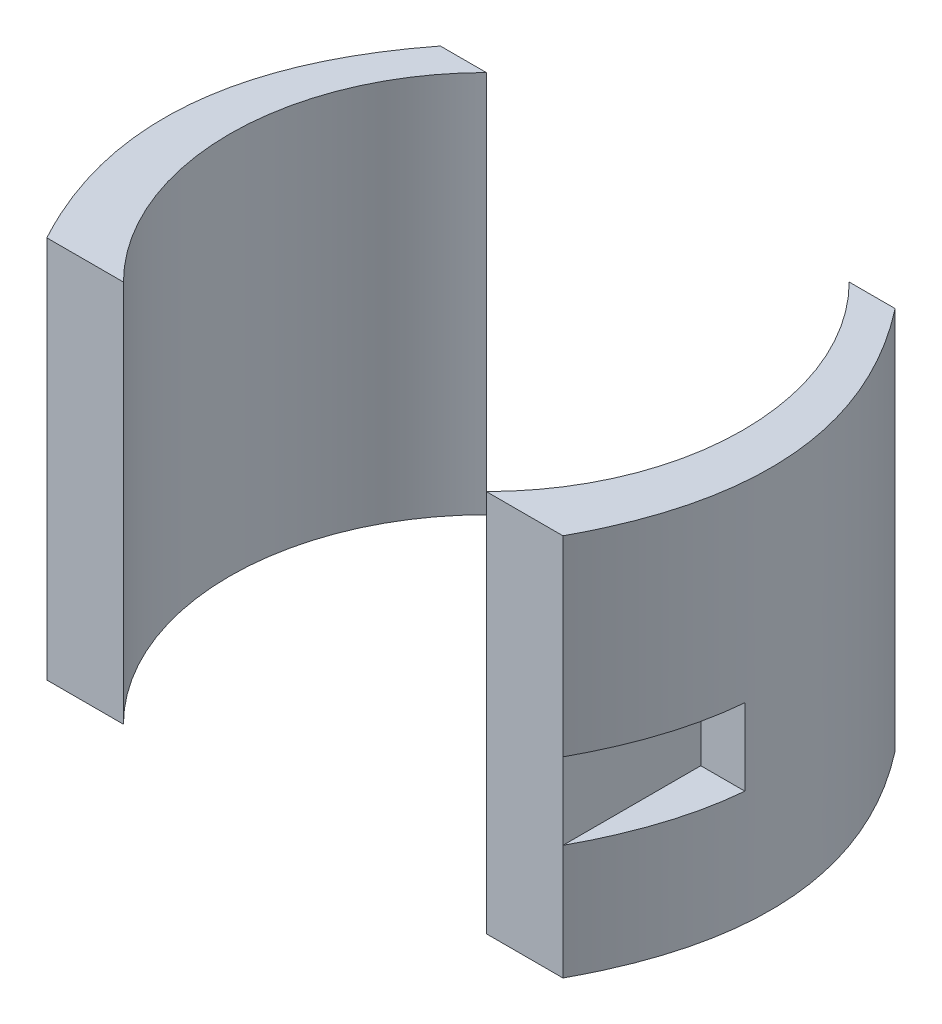
ISO-10303-21;
HEADER;
FILE_DESCRIPTION(('STEP AP214'),'2;1');
FILE_NAME('part.step','',(''),(''),'','','');
FILE_SCHEMA(('AUTOMOTIVE_DESIGN { 1 0 10303 214 1 1 1 1 }'));
ENDSEC;
DATA;
#1=APPLICATION_CONTEXT('core data for automotive mechanical design processes');
#2=APPLICATION_PROTOCOL_DEFINITION('international standard','automotive_design',2000,#1);
#3=PRODUCT_CONTEXT('',#1,'mechanical');
#4=PRODUCT('Part','Part','',(#3));
#5=PRODUCT_RELATED_PRODUCT_CATEGORY('part','',(#4));
#6=PRODUCT_DEFINITION_FORMATION('','',#4);
#7=PRODUCT_DEFINITION_CONTEXT('part definition',#1,'design');
#8=PRODUCT_DEFINITION('design','',#6,#7);
#9=PRODUCT_DEFINITION_SHAPE('','',#8);
#10=(LENGTH_UNIT() NAMED_UNIT(*) SI_UNIT(.MILLI.,.METRE.));
#11=(NAMED_UNIT(*) PLANE_ANGLE_UNIT() SI_UNIT($,.RADIAN.));
#12=(NAMED_UNIT(*) SI_UNIT($,.STERADIAN.) SOLID_ANGLE_UNIT());
#13=UNCERTAINTY_MEASURE_WITH_UNIT(LENGTH_MEASURE(1.E-05),#10,'distance_accuracy_value','');
#14=(GEOMETRIC_REPRESENTATION_CONTEXT(3) GLOBAL_UNCERTAINTY_ASSIGNED_CONTEXT((#13)) GLOBAL_UNIT_ASSIGNED_CONTEXT((#10,
#11,#12)) REPRESENTATION_CONTEXT('',''));
#15=CARTESIAN_POINT('',(0.,0.,0.));
#16=DIRECTION('',(0.,0.,1.));
#17=DIRECTION('',(1.,0.,0.));
#18=AXIS2_PLACEMENT_3D('',#15,#16,#17);
#19=CARTESIAN_POINT('',(29.6880771697493,50.,-23.6880771697493));
#20=CARTESIAN_POINT('',(47.2217353331707,50.,-1.18361385183468));
#21=CARTESIAN_POINT('',(33.6880771697494,50.,23.6880771697493));
#22=B_SPLINE_CURVE_WITH_KNOTS('',2,(#19,#20,#21),.UNSPECIFIED.,.F.,.F.,(3,3),(0.,1.),.UNSPECIFIED.);
#23=DIRECTION('',(0.,-1.,0.));
#24=VECTOR('',#23,1.);
#25=SURFACE_OF_LINEAR_EXTRUSION('',#22,#24);
#26=CARTESIAN_POINT('',(29.6880771697493,25.,-23.6880771697493));
#27=CARTESIAN_POINT('',(47.2217353331707,25.,-1.18361385183468));
#28=CARTESIAN_POINT('',(33.6880771697494,25.,23.6880771697493));
#29=B_SPLINE_CURVE_WITH_KNOTS('',2,(#26,#27,#28),.UNSPECIFIED.,.F.,.F.,(3,3),(0.,1.),.UNSPECIFIED.);
#30=CARTESIAN_POINT('',(39.4429006357392,25.,5.68807716974934));
#31=VERTEX_POINT('',#30);
#32=CARTESIAN_POINT('',(33.6880771697493,25.,23.6880771697493));
#33=VERTEX_POINT('',#32);
#34=EDGE_CURVE('E12',#31,#33,#29,.T.);
#35=ORIENTED_EDGE('',*,*,#34,.F.);
#36=DIRECTION('',(0.,-1.,0.));
#37=VECTOR('',#36,1.);
#38=CARTESIAN_POINT('',(39.4429006357392,50.,5.68807716974934));
#39=LINE('',#38,#37);
#40=CARTESIAN_POINT('',(39.4429006357392,15.,5.68807716974934));
#41=VERTEX_POINT('',#40);
#42=EDGE_CURVE('E130',#41,#31,#39,.F.);
#43=ORIENTED_EDGE('',*,*,#42,.F.);
#44=CARTESIAN_POINT('',(29.6880771697493,15.,-23.6880771697493));
#45=CARTESIAN_POINT('',(47.2217353331707,15.,-1.18361385183468));
#46=CARTESIAN_POINT('',(33.6880771697494,15.,23.6880771697493));
#47=B_SPLINE_CURVE_WITH_KNOTS('',2,(#44,#45,#46),.UNSPECIFIED.,.F.,.F.,(3,3),(0.,1.),.UNSPECIFIED.);
#48=CARTESIAN_POINT('',(33.6880771697494,15.,23.6880771697493));
#49=VERTEX_POINT('',#48);
#50=EDGE_CURVE('E63',#49,#41,#47,.F.);
#51=ORIENTED_EDGE('',*,*,#50,.F.);
#52=DIRECTION('',(0.,-1.,0.));
#53=VECTOR('',#52,1.);
#54=CARTESIAN_POINT('',(33.6880771697493,50.,23.6880771697493));
#55=LINE('',#54,#53);
#56=CARTESIAN_POINT('',(33.6880771697493,0.,23.6880771697493));
#57=VERTEX_POINT('',#56);
#58=EDGE_CURVE('E101',#49,#57,#55,.T.);
#59=ORIENTED_EDGE('',*,*,#58,.T.);
#60=CARTESIAN_POINT('',(29.6880771697493,0.,-23.6880771697493));
#61=CARTESIAN_POINT('',(47.2217353331707,0.,-1.18361385183468));
#62=CARTESIAN_POINT('',(33.6880771697494,0.,23.6880771697493));
#63=B_SPLINE_CURVE_WITH_KNOTS('',2,(#60,#61,#62),.UNSPECIFIED.,.F.,.F.,(3,3),(0.,1.),.UNSPECIFIED.);
#64=CARTESIAN_POINT('',(29.6880771697493,0.,-23.6880771697493));
#65=VERTEX_POINT('',#64);
#66=EDGE_CURVE('E146',#65,#57,#63,.T.);
#67=ORIENTED_EDGE('',*,*,#66,.F.);
#68=DIRECTION('',(0.,-1.,0.));
#69=VECTOR('',#68,1.);
#70=CARTESIAN_POINT('',(29.6880771697493,50.,-23.6880771697493));
#71=LINE('',#70,#69);
#72=CARTESIAN_POINT('',(29.6880771697493,50.,-23.6880771697493));
#73=VERTEX_POINT('',#72);
#74=EDGE_CURVE('E106',#73,#65,#71,.T.);
#75=ORIENTED_EDGE('',*,*,#74,.F.);
#76=CARTESIAN_POINT('',(33.6880771697493,50.,23.6880771697493));
#77=VERTEX_POINT('',#76);
#78=EDGE_CURVE('E147',#73,#77,#22,.T.);
#79=ORIENTED_EDGE('',*,*,#78,.T.);
#80=EDGE_CURVE('E177',#77,#33,#55,.T.);
#81=ORIENTED_EDGE('',*,*,#80,.T.);
#82=EDGE_LOOP('',(#35,#43,#51,#59,#67,#75,#79,#81));
#83=FACE_BOUND('',#82,.T.);
#84=ADVANCED_FACE('F53',(#83),#25,.T.);
#85=CARTESIAN_POINT('',(0.,50.,-23.6880771697493));
#86=DIRECTION('',(0.,0.,-1.));
#87=DIRECTION('',(-1.,0.,0.));
#88=AXIS2_PLACEMENT_3D('',#85,#86,#87);
#89=PLANE('',#88);
#90=DIRECTION('',(1.,0.,0.));
#91=VECTOR('',#90,1.);
#92=CARTESIAN_POINT('',(0.,0.,-23.6880771697493));
#93=LINE('',#92,#91);
#94=CARTESIAN_POINT('',(23.6880771697493,0.,-23.6880771697493));
#95=VERTEX_POINT('',#94);
#96=EDGE_CURVE('E167',#95,#65,#93,.T.);
#97=ORIENTED_EDGE('',*,*,#96,.F.);
#98=DIRECTION('',(0.,-1.,0.));
#99=VECTOR('',#98,1.);
#100=CARTESIAN_POINT('',(23.6880771697493,50.,-23.6880771697493));
#101=LINE('',#100,#99);
#102=CARTESIAN_POINT('',(23.6880771697493,50.,-23.6880771697493));
#103=VERTEX_POINT('',#102);
#104=EDGE_CURVE('E182',#103,#95,#101,.T.);
#105=ORIENTED_EDGE('',*,*,#104,.F.);
#106=DIRECTION('',(1.,0.,0.));
#107=VECTOR('',#106,1.);
#108=CARTESIAN_POINT('',(0.,50.,-23.6880771697493));
#109=LINE('',#108,#107);
#110=EDGE_CURVE('E152',#103,#73,#109,.T.);
#111=ORIENTED_EDGE('',*,*,#110,.T.);
#112=ORIENTED_EDGE('',*,*,#74,.T.);
#113=EDGE_LOOP('',(#97,#105,#111,#112));
#114=FACE_BOUND('',#113,.T.);
#115=ADVANCED_FACE('F200',(#114),#89,.T.);
#116=CARTESIAN_POINT('',(0.,50.,0.));
#117=DIRECTION('',(0.,-1.,0.));
#118=DIRECTION('',(0.,0.,-1.));
#119=AXIS2_PLACEMENT_3D('',#116,#117,#118);
#120=CYLINDRICAL_SURFACE('',#119,33.5);
#121=CARTESIAN_POINT('',(0.,0.,0.));
#122=DIRECTION('',(0.,1.,0.));
#123=DIRECTION('',(0.,0.,1.));
#124=AXIS2_PLACEMENT_3D('',#121,#122,#123);
#125=CIRCLE('',#124,33.5);
#126=CARTESIAN_POINT('',(23.6880771697494,0.,23.6880771697493));
#127=VERTEX_POINT('',#126);
#128=EDGE_CURVE('E173',#127,#95,#125,.T.);
#129=ORIENTED_EDGE('',*,*,#128,.F.);
#130=DIRECTION('',(0.,-1.,0.));
#131=VECTOR('',#130,1.);
#132=CARTESIAN_POINT('',(23.6880771697494,50.,23.6880771697493));
#133=LINE('',#132,#131);
#134=CARTESIAN_POINT('',(23.6880771697494,50.,23.6880771697493));
#135=VERTEX_POINT('',#134);
#136=EDGE_CURVE('E180',#135,#127,#133,.T.);
#137=ORIENTED_EDGE('',*,*,#136,.F.);
#138=CARTESIAN_POINT('',(0.,50.,0.));
#139=DIRECTION('',(0.,1.,0.));
#140=DIRECTION('',(0.,0.,1.));
#141=AXIS2_PLACEMENT_3D('',#138,#139,#140);
#142=CIRCLE('',#141,33.5);
#143=EDGE_CURVE('E159',#135,#103,#142,.T.);
#144=ORIENTED_EDGE('',*,*,#143,.T.);
#145=ORIENTED_EDGE('',*,*,#104,.T.);
#146=EDGE_LOOP('',(#129,#137,#144,#145));
#147=FACE_BOUND('',#146,.T.);
#148=ADVANCED_FACE('F204',(#147),#120,.F.);
#149=CARTESIAN_POINT('',(0.,50.,23.6880771697493));
#150=DIRECTION('',(0.,0.,-1.));
#151=DIRECTION('',(-1.,0.,0.));
#152=AXIS2_PLACEMENT_3D('',#149,#150,#151);
#153=PLANE('',#152);
#154=DIRECTION('',(1.,0.,0.));
#155=VECTOR('',#154,1.);
#156=CARTESIAN_POINT('',(0.,0.,23.6880771697493));
#157=LINE('',#156,#155);
#158=EDGE_CURVE('E153',#127,#57,#157,.T.);
#159=ORIENTED_EDGE('',*,*,#158,.T.);
#160=ORIENTED_EDGE('',*,*,#58,.F.);
#161=DIRECTION('',(0.,-1.,0.));
#162=VECTOR('',#161,1.);
#163=CARTESIAN_POINT('',(33.6880771697494,25.,23.6880771697493));
#164=LINE('',#163,#162);
#165=EDGE_CURVE('E133',#33,#49,#164,.T.);
#166=ORIENTED_EDGE('',*,*,#165,.F.);
#167=ORIENTED_EDGE('',*,*,#80,.F.);
#168=DIRECTION('',(1.,0.,0.));
#169=VECTOR('',#168,1.);
#170=CARTESIAN_POINT('',(0.,50.,23.6880771697493));
#171=LINE('',#170,#169);
#172=EDGE_CURVE('E78',#135,#77,#171,.T.);
#173=ORIENTED_EDGE('',*,*,#172,.F.);
#174=ORIENTED_EDGE('',*,*,#136,.T.);
#175=EDGE_LOOP('',(#159,#160,#166,#167,#173,#174));
#176=FACE_BOUND('',#175,.T.);
#177=ADVANCED_FACE('F193',(#176),#153,.F.);
#178=CARTESIAN_POINT('',(0.,50.,0.));
#179=DIRECTION('',(0.,1.,0.));
#180=DIRECTION('',(0.,0.,1.));
#181=AXIS2_PLACEMENT_3D('',#178,#179,#180);
#182=PLANE('',#181);
#183=ORIENTED_EDGE('',*,*,#78,.F.);
#184=ORIENTED_EDGE('',*,*,#110,.F.);
#185=ORIENTED_EDGE('',*,*,#143,.F.);
#186=ORIENTED_EDGE('',*,*,#172,.T.);
#187=EDGE_LOOP('',(#183,#184,#185,#186));
#188=FACE_BOUND('',#187,.T.);
#189=ADVANCED_FACE('F202',(#188),#182,.T.);
#190=CARTESIAN_POINT('',(0.,0.,0.));
#191=DIRECTION('',(0.,1.,0.));
#192=DIRECTION('',(0.,0.,1.));
#193=AXIS2_PLACEMENT_3D('',#190,#191,#192);
#194=PLANE('',#193);
#195=ORIENTED_EDGE('',*,*,#66,.T.);
#196=ORIENTED_EDGE('',*,*,#158,.F.);
#197=ORIENTED_EDGE('',*,*,#128,.T.);
#198=ORIENTED_EDGE('',*,*,#96,.T.);
#199=EDGE_LOOP('',(#195,#196,#197,#198));
#200=FACE_BOUND('',#199,.T.);
#201=ADVANCED_FACE('F197',(#200),#194,.F.);
#202=CARTESIAN_POINT('',(33.6880771697494,25.,5.68807716974934));
#203=DIRECTION('',(0.,1.,0.));
#204=DIRECTION('',(0.,0.,1.));
#205=AXIS2_PLACEMENT_3D('',#202,#203,#204);
#206=PLANE('',#205);
#207=ORIENTED_EDGE('',*,*,#34,.T.);
#208=DIRECTION('',(0.,0.,1.));
#209=VECTOR('',#208,1.);
#210=CARTESIAN_POINT('',(33.6880771697494,25.,5.68807716974934));
#211=LINE('',#210,#209);
#212=CARTESIAN_POINT('',(33.6880771697494,25.,5.68807716974934));
#213=VERTEX_POINT('',#212);
#214=EDGE_CURVE('E70',#213,#33,#211,.T.);
#215=ORIENTED_EDGE('',*,*,#214,.F.);
#216=DIRECTION('',(-1.,0.,0.));
#217=VECTOR('',#216,1.);
#218=CARTESIAN_POINT('',(33.6880771697494,25.,5.68807716974934));
#219=LINE('',#218,#217);
#220=EDGE_CURVE('E125',#31,#213,#219,.T.);
#221=ORIENTED_EDGE('',*,*,#220,.F.);
#222=EDGE_LOOP('',(#207,#215,#221));
#223=FACE_BOUND('',#222,.T.);
#224=ADVANCED_FACE('F135',(#223),#206,.F.);
#225=CARTESIAN_POINT('',(33.6880771697494,15.,5.68807716974934));
#226=DIRECTION('',(0.,-1.,0.));
#227=DIRECTION('',(1.,0.,0.));
#228=AXIS2_PLACEMENT_3D('',#225,#226,#227);
#229=PLANE('',#228);
#230=ORIENTED_EDGE('',*,*,#50,.T.);
#231=DIRECTION('',(1.,0.,0.));
#232=VECTOR('',#231,1.);
#233=CARTESIAN_POINT('',(33.6880771697494,15.,5.68807716974934));
#234=LINE('',#233,#232);
#235=CARTESIAN_POINT('',(33.6880771697494,15.,5.68807716974934));
#236=VERTEX_POINT('',#235);
#237=EDGE_CURVE('E138',#236,#41,#234,.T.);
#238=ORIENTED_EDGE('',*,*,#237,.F.);
#239=DIRECTION('',(0.,0.,1.));
#240=VECTOR('',#239,1.);
#241=CARTESIAN_POINT('',(33.6880771697494,15.,5.68807716974934));
#242=LINE('',#241,#240);
#243=EDGE_CURVE('E137',#236,#49,#242,.T.);
#244=ORIENTED_EDGE('',*,*,#243,.T.);
#245=EDGE_LOOP('',(#230,#238,#244));
#246=FACE_BOUND('',#245,.T.);
#247=ADVANCED_FACE('F191',(#246),#229,.F.);
#248=CARTESIAN_POINT('',(33.6880771697494,25.,5.68807716974934));
#249=DIRECTION('',(-1.,0.,0.));
#250=DIRECTION('',(0.,-1.,0.));
#251=AXIS2_PLACEMENT_3D('',#248,#249,#250);
#252=PLANE('',#251);
#253=ORIENTED_EDGE('',*,*,#165,.T.);
#254=ORIENTED_EDGE('',*,*,#243,.F.);
#255=DIRECTION('',(0.,-1.,0.));
#256=VECTOR('',#255,1.);
#257=CARTESIAN_POINT('',(33.6880771697494,25.,5.68807716974934));
#258=LINE('',#257,#256);
#259=EDGE_CURVE('E128',#213,#236,#258,.T.);
#260=ORIENTED_EDGE('',*,*,#259,.F.);
#261=ORIENTED_EDGE('',*,*,#214,.T.);
#262=EDGE_LOOP('',(#253,#254,#260,#261));
#263=FACE_BOUND('',#262,.T.);
#264=ADVANCED_FACE('F140',(#263),#252,.F.);
#265=CARTESIAN_POINT('',(0.,0.,5.68807716974934));
#266=DIRECTION('',(0.,0.,-1.));
#267=DIRECTION('',(-1.,0.,0.));
#268=AXIS2_PLACEMENT_3D('',#265,#266,#267);
#269=PLANE('',#268);
#270=ORIENTED_EDGE('',*,*,#42,.T.);
#271=ORIENTED_EDGE('',*,*,#220,.T.);
#272=ORIENTED_EDGE('',*,*,#259,.T.);
#273=ORIENTED_EDGE('',*,*,#237,.T.);
#274=EDGE_LOOP('',(#270,#271,#272,#273));
#275=FACE_BOUND('',#274,.T.);
#276=ADVANCED_FACE('F126',(#275),#269,.F.);
#277=CLOSED_SHELL('',(#84,#115,#148,#177,#189,#201,#224,#247,#264,#276));
#278=MANIFOLD_SOLID_BREP('B2',#277);
#279=CARTESIAN_POINT('',(0.,50.,-23.6880771697493));
#280=DIRECTION('',(0.,0.,1.));
#281=DIRECTION('',(1.,0.,0.));
#282=AXIS2_PLACEMENT_3D('',#279,#280,#281);
#283=PLANE('',#282);
#284=DIRECTION('',(-1.,0.,0.));
#285=VECTOR('',#284,1.);
#286=CARTESIAN_POINT('',(0.,0.,-23.6880771697493));
#287=LINE('',#286,#285);
#288=CARTESIAN_POINT('',(-23.6880771697493,0.,-23.6880771697493));
#289=VERTEX_POINT('',#288);
#290=CARTESIAN_POINT('',(-29.6880771697493,0.,-23.6880771697493));
#291=VERTEX_POINT('',#290);
#292=EDGE_CURVE('E387',#289,#291,#287,.T.);
#293=ORIENTED_EDGE('',*,*,#292,.T.);
#294=DIRECTION('',(0.,-1.,0.));
#295=VECTOR('',#294,1.);
#296=CARTESIAN_POINT('',(-29.6880771697493,50.,-23.6880771697493));
#297=LINE('',#296,#295);
#298=CARTESIAN_POINT('',(-29.6880771697493,50.,-23.6880771697493));
#299=VERTEX_POINT('',#298);
#300=EDGE_CURVE('E436',#299,#291,#297,.T.);
#301=ORIENTED_EDGE('',*,*,#300,.F.);
#302=DIRECTION('',(-1.,0.,0.));
#303=VECTOR('',#302,1.);
#304=CARTESIAN_POINT('',(0.,50.,-23.6880771697493));
#305=LINE('',#304,#303);
#306=CARTESIAN_POINT('',(-23.6880771697493,50.,-23.6880771697493));
#307=VERTEX_POINT('',#306);
#308=EDGE_CURVE('E389',#307,#299,#305,.T.);
#309=ORIENTED_EDGE('',*,*,#308,.F.);
#310=DIRECTION('',(0.,-1.,0.));
#311=VECTOR('',#310,1.);
#312=CARTESIAN_POINT('',(-23.6880771697493,50.,-23.6880771697493));
#313=LINE('',#312,#311);
#314=EDGE_CURVE('E315',#307,#289,#313,.T.);
#315=ORIENTED_EDGE('',*,*,#314,.T.);
#316=EDGE_LOOP('',(#293,#301,#309,#315));
#317=FACE_BOUND('',#316,.T.);
#318=ADVANCED_FACE('F289',(#317),#283,.F.);
#319=CARTESIAN_POINT('',(-29.6880771697493,50.,-23.6880771697493));
#320=CARTESIAN_POINT('',(-47.2217353331707,50.,-1.18361385183467));
#321=CARTESIAN_POINT('',(-33.6880771697493,50.,23.6880771697493));
#322=B_SPLINE_CURVE_WITH_KNOTS('',2,(#319,#320,#321),.UNSPECIFIED.,.F.,.F.,(3,3),(0.,1.),.UNSPECIFIED.);
#323=DIRECTION('',(0.,-1.,0.));
#324=VECTOR('',#323,1.);
#325=SURFACE_OF_LINEAR_EXTRUSION('',#322,#324);
#326=DIRECTION('',(0.,-1.,0.));
#327=VECTOR('',#326,1.);
#328=CARTESIAN_POINT('',(-33.6880771697493,50.,23.6880771697493));
#329=LINE('',#328,#327);
#330=CARTESIAN_POINT('',(-33.6880771697493,15.,23.6880771697493));
#331=VERTEX_POINT('',#330);
#332=CARTESIAN_POINT('',(-33.6880771697493,0.,23.6880771697493));
#333=VERTEX_POINT('',#332);
#334=EDGE_CURVE('E462',#331,#333,#329,.T.);
#335=ORIENTED_EDGE('',*,*,#334,.F.);
#336=CARTESIAN_POINT('',(-29.6880771697493,15.,-23.6880771697493));
#337=CARTESIAN_POINT('',(-47.2217353331707,15.,-1.18361385183467));
#338=CARTESIAN_POINT('',(-33.6880771697493,15.,23.6880771697493));
#339=B_SPLINE_CURVE_WITH_KNOTS('',2,(#336,#337,#338),.UNSPECIFIED.,.F.,.F.,(3,3),(0.,1.),.UNSPECIFIED.);
#340=CARTESIAN_POINT('',(-39.4429006357392,15.,5.68807716974934));
#341=VERTEX_POINT('',#340);
#342=EDGE_CURVE('E51',#331,#341,#339,.F.);
#343=ORIENTED_EDGE('',*,*,#342,.T.);
#344=DIRECTION('',(0.,-1.,0.));
#345=VECTOR('',#344,1.);
#346=CARTESIAN_POINT('',(-39.4429006357392,50.,5.68807716974934));
#347=LINE('',#346,#345);
#348=CARTESIAN_POINT('',(-39.4429006357392,25.,5.68807716974934));
#349=VERTEX_POINT('',#348);
#350=EDGE_CURVE('E469',#341,#349,#347,.F.);
#351=ORIENTED_EDGE('',*,*,#350,.T.);
#352=CARTESIAN_POINT('',(-29.6880771697493,25.,-23.6880771697493));
#353=CARTESIAN_POINT('',(-47.2217353331707,25.,-1.18361385183467));
#354=CARTESIAN_POINT('',(-33.6880771697493,25.,23.6880771697493));
#355=B_SPLINE_CURVE_WITH_KNOTS('',2,(#352,#353,#354),.UNSPECIFIED.,.F.,.F.,(3,3),(0.,1.),.UNSPECIFIED.);
#356=CARTESIAN_POINT('',(-33.6880771697493,25.,23.6880771697493));
#357=VERTEX_POINT('',#356);
#358=EDGE_CURVE('E299',#349,#357,#355,.T.);
#359=ORIENTED_EDGE('',*,*,#358,.T.);
#360=CARTESIAN_POINT('',(-33.6880771697493,50.,23.6880771697493));
#361=VERTEX_POINT('',#360);
#362=EDGE_CURVE('E463',#361,#357,#329,.T.);
#363=ORIENTED_EDGE('',*,*,#362,.F.);
#364=EDGE_CURVE('E342',#299,#361,#322,.T.);
#365=ORIENTED_EDGE('',*,*,#364,.F.);
#366=ORIENTED_EDGE('',*,*,#300,.T.);
#367=CARTESIAN_POINT('',(-29.6880771697493,0.,-23.6880771697493));
#368=CARTESIAN_POINT('',(-47.2217353331707,0.,-1.18361385183467));
#369=CARTESIAN_POINT('',(-33.6880771697493,0.,23.6880771697493));
#370=B_SPLINE_CURVE_WITH_KNOTS('',2,(#367,#368,#369),.UNSPECIFIED.,.F.,.F.,(3,3),(0.,1.),.UNSPECIFIED.);
#371=EDGE_CURVE('E439',#291,#333,#370,.T.);
#372=ORIENTED_EDGE('',*,*,#371,.T.);
#373=EDGE_LOOP('',(#335,#343,#351,#359,#363,#365,#366,#372));
#374=FACE_BOUND('',#373,.T.);
#375=ADVANCED_FACE('F403',(#374),#325,.F.);
#376=CARTESIAN_POINT('',(0.,50.,23.6880771697493));
#377=DIRECTION('',(0.,0.,1.));
#378=DIRECTION('',(1.,0.,0.));
#379=AXIS2_PLACEMENT_3D('',#376,#377,#378);
#380=PLANE('',#379);
#381=DIRECTION('',(-1.,0.,0.));
#382=VECTOR('',#381,1.);
#383=CARTESIAN_POINT('',(0.,0.,23.6880771697493));
#384=LINE('',#383,#382);
#385=CARTESIAN_POINT('',(-23.6880771697493,0.,23.6880771697493));
#386=VERTEX_POINT('',#385);
#387=EDGE_CURVE('E443',#386,#333,#384,.T.);
#388=ORIENTED_EDGE('',*,*,#387,.F.);
#389=DIRECTION('',(0.,-1.,0.));
#390=VECTOR('',#389,1.);
#391=CARTESIAN_POINT('',(-23.6880771697493,50.,23.6880771697493));
#392=LINE('',#391,#390);
#393=CARTESIAN_POINT('',(-23.6880771697493,50.,23.6880771697493));
#394=VERTEX_POINT('',#393);
#395=EDGE_CURVE('E459',#394,#386,#392,.T.);
#396=ORIENTED_EDGE('',*,*,#395,.F.);
#397=DIRECTION('',(-1.,0.,0.));
#398=VECTOR('',#397,1.);
#399=CARTESIAN_POINT('',(0.,50.,23.6880771697493));
#400=LINE('',#399,#398);
#401=EDGE_CURVE('E398',#394,#361,#400,.T.);
#402=ORIENTED_EDGE('',*,*,#401,.T.);
#403=ORIENTED_EDGE('',*,*,#362,.T.);
#404=DIRECTION('',(0.,1.,0.));
#405=VECTOR('',#404,1.);
#406=CARTESIAN_POINT('',(-33.6880771697493,25.,23.6880771697493));
#407=LINE('',#406,#405);
#408=EDGE_CURVE('E364',#331,#357,#407,.T.);
#409=ORIENTED_EDGE('',*,*,#408,.F.);
#410=ORIENTED_EDGE('',*,*,#334,.T.);
#411=EDGE_LOOP('',(#388,#396,#402,#403,#409,#410));
#412=FACE_BOUND('',#411,.T.);
#413=ADVANCED_FACE('F406',(#412),#380,.T.);
#414=CARTESIAN_POINT('',(0.,50.,0.));
#415=DIRECTION('',(0.,-1.,0.));
#416=DIRECTION('',(0.,0.,-1.));
#417=AXIS2_PLACEMENT_3D('',#414,#415,#416);
#418=CYLINDRICAL_SURFACE('',#417,33.5);
#419=CARTESIAN_POINT('',(0.,0.,0.));
#420=DIRECTION('',(0.,1.,0.));
#421=DIRECTION('',(0.,0.,1.));
#422=AXIS2_PLACEMENT_3D('',#419,#420,#421);
#423=CIRCLE('',#422,33.5);
#424=EDGE_CURVE('E392',#289,#386,#423,.T.);
#425=ORIENTED_EDGE('',*,*,#424,.F.);
#426=ORIENTED_EDGE('',*,*,#314,.F.);
#427=CARTESIAN_POINT('',(0.,50.,0.));
#428=DIRECTION('',(0.,1.,0.));
#429=DIRECTION('',(0.,0.,1.));
#430=AXIS2_PLACEMENT_3D('',#427,#428,#429);
#431=CIRCLE('',#430,33.5);
#432=EDGE_CURVE('E445',#307,#394,#431,.T.);
#433=ORIENTED_EDGE('',*,*,#432,.T.);
#434=ORIENTED_EDGE('',*,*,#395,.T.);
#435=EDGE_LOOP('',(#425,#426,#433,#434));
#436=FACE_BOUND('',#435,.T.);
#437=ADVANCED_FACE('F409',(#436),#418,.F.);
#438=CARTESIAN_POINT('',(0.,50.,0.));
#439=DIRECTION('',(0.,1.,0.));
#440=DIRECTION('',(0.,0.,1.));
#441=AXIS2_PLACEMENT_3D('',#438,#439,#440);
#442=PLANE('',#441);
#443=ORIENTED_EDGE('',*,*,#308,.T.);
#444=ORIENTED_EDGE('',*,*,#364,.T.);
#445=ORIENTED_EDGE('',*,*,#401,.F.);
#446=ORIENTED_EDGE('',*,*,#432,.F.);
#447=EDGE_LOOP('',(#443,#444,#445,#446));
#448=FACE_BOUND('',#447,.T.);
#449=ADVANCED_FACE('F413',(#448),#442,.T.);
#450=CARTESIAN_POINT('',(0.,0.,0.));
#451=DIRECTION('',(0.,1.,0.));
#452=DIRECTION('',(0.,0.,1.));
#453=AXIS2_PLACEMENT_3D('',#450,#451,#452);
#454=PLANE('',#453);
#455=ORIENTED_EDGE('',*,*,#292,.F.);
#456=ORIENTED_EDGE('',*,*,#424,.T.);
#457=ORIENTED_EDGE('',*,*,#387,.T.);
#458=ORIENTED_EDGE('',*,*,#371,.F.);
#459=EDGE_LOOP('',(#455,#456,#457,#458));
#460=FACE_BOUND('',#459,.T.);
#461=ADVANCED_FACE('F414',(#460),#454,.F.);
#462=CARTESIAN_POINT('',(-33.6880771697493,15.,5.68807716974934));
#463=DIRECTION('',(0.,-1.,0.));
#464=DIRECTION('',(1.,0.,0.));
#465=AXIS2_PLACEMENT_3D('',#462,#463,#464);
#466=PLANE('',#465);
#467=DIRECTION('',(0.,0.,1.));
#468=VECTOR('',#467,1.);
#469=CARTESIAN_POINT('',(-33.6880771697493,15.,5.68807716974934));
#470=LINE('',#469,#468);
#471=CARTESIAN_POINT('',(-33.6880771697493,15.,5.68807716974934));
#472=VERTEX_POINT('',#471);
#473=EDGE_CURVE('E306',#472,#331,#470,.T.);
#474=ORIENTED_EDGE('',*,*,#473,.F.);
#475=DIRECTION('',(1.,0.,0.));
#476=VECTOR('',#475,1.);
#477=CARTESIAN_POINT('',(-33.6880771697493,15.,5.68807716974934));
#478=LINE('',#477,#476);
#479=EDGE_CURVE('E368',#341,#472,#478,.T.);
#480=ORIENTED_EDGE('',*,*,#479,.F.);
#481=ORIENTED_EDGE('',*,*,#342,.F.);
#482=EDGE_LOOP('',(#474,#480,#481));
#483=FACE_BOUND('',#482,.T.);
#484=ADVANCED_FACE('F417',(#483),#466,.F.);
#485=CARTESIAN_POINT('',(-33.6880771697493,25.,5.68807716974934));
#486=DIRECTION('',(0.,1.,0.));
#487=DIRECTION('',(-1.,0.,0.));
#488=AXIS2_PLACEMENT_3D('',#485,#486,#487);
#489=PLANE('',#488);
#490=DIRECTION('',(-1.,0.,0.));
#491=VECTOR('',#490,1.);
#492=CARTESIAN_POINT('',(-33.6880771697493,25.,5.68807716974934));
#493=LINE('',#492,#491);
#494=CARTESIAN_POINT('',(-33.6880771697493,25.,5.68807716974934));
#495=VERTEX_POINT('',#494);
#496=EDGE_CURVE('E371',#495,#349,#493,.T.);
#497=ORIENTED_EDGE('',*,*,#496,.F.);
#498=DIRECTION('',(0.,0.,1.));
#499=VECTOR('',#498,1.);
#500=CARTESIAN_POINT('',(-33.6880771697493,25.,5.68807716974934));
#501=LINE('',#500,#499);
#502=EDGE_CURVE('E358',#495,#357,#501,.T.);
#503=ORIENTED_EDGE('',*,*,#502,.T.);
#504=ORIENTED_EDGE('',*,*,#358,.F.);
#505=EDGE_LOOP('',(#497,#503,#504));
#506=FACE_BOUND('',#505,.T.);
#507=ADVANCED_FACE('F372',(#506),#489,.F.);
#508=CARTESIAN_POINT('',(0.,0.,5.68807716974934));
#509=DIRECTION('',(0.,0.,-1.));
#510=DIRECTION('',(-1.,0.,0.));
#511=AXIS2_PLACEMENT_3D('',#508,#509,#510);
#512=PLANE('',#511);
#513=ORIENTED_EDGE('',*,*,#479,.T.);
#514=DIRECTION('',(0.,1.,0.));
#515=VECTOR('',#514,1.);
#516=CARTESIAN_POINT('',(-33.6880771697493,25.,5.68807716974934));
#517=LINE('',#516,#515);
#518=EDGE_CURVE('E362',#472,#495,#517,.T.);
#519=ORIENTED_EDGE('',*,*,#518,.T.);
#520=ORIENTED_EDGE('',*,*,#496,.T.);
#521=ORIENTED_EDGE('',*,*,#350,.F.);
#522=EDGE_LOOP('',(#513,#519,#520,#521));
#523=FACE_BOUND('',#522,.T.);
#524=ADVANCED_FACE('F377',(#523),#512,.F.);
#525=CARTESIAN_POINT('',(-33.6880771697493,25.,5.68807716974934));
#526=DIRECTION('',(1.,0.,0.));
#527=DIRECTION('',(0.,0.,-1.));
#528=AXIS2_PLACEMENT_3D('',#525,#526,#527);
#529=PLANE('',#528);
#530=ORIENTED_EDGE('',*,*,#408,.T.);
#531=ORIENTED_EDGE('',*,*,#502,.F.);
#532=ORIENTED_EDGE('',*,*,#518,.F.);
#533=ORIENTED_EDGE('',*,*,#473,.T.);
#534=EDGE_LOOP('',(#530,#531,#532,#533));
#535=FACE_BOUND('',#534,.T.);
#536=ADVANCED_FACE('F360',(#535),#529,.F.);
#537=CLOSED_SHELL('',(#318,#375,#413,#437,#449,#461,#484,#507,#524,#536));
#538=MANIFOLD_SOLID_BREP('B6',#537);
#539=ADVANCED_BREP_SHAPE_REPRESENTATION('',(#18,#278,#538),#14);
#540=SHAPE_DEFINITION_REPRESENTATION(#9,#539);
ENDSEC;
END-ISO-10303-21;
